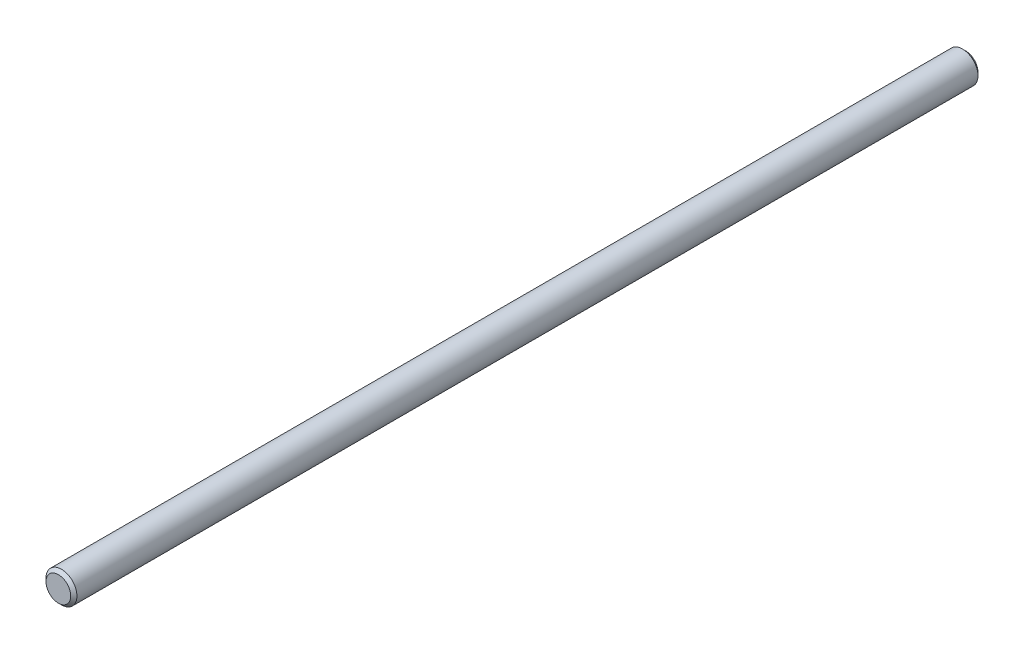
ISO-10303-21;
HEADER;
FILE_DESCRIPTION(('STEP AP214'),'2;1');
FILE_NAME('part.step','',(''),(''),'','','');
FILE_SCHEMA(('AUTOMOTIVE_DESIGN { 1 0 10303 214 1 1 1 1 }'));
ENDSEC;
DATA;
#1=APPLICATION_CONTEXT('core data for automotive mechanical design processes');
#2=APPLICATION_PROTOCOL_DEFINITION('international standard','automotive_design',2000,#1);
#3=PRODUCT_CONTEXT('',#1,'mechanical');
#4=PRODUCT('Part','Part','',(#3));
#5=PRODUCT_RELATED_PRODUCT_CATEGORY('part','',(#4));
#6=PRODUCT_DEFINITION_FORMATION('','',#4);
#7=PRODUCT_DEFINITION_CONTEXT('part definition',#1,'design');
#8=PRODUCT_DEFINITION('design','',#6,#7);
#9=PRODUCT_DEFINITION_SHAPE('','',#8);
#10=(LENGTH_UNIT() NAMED_UNIT(*) SI_UNIT(.MILLI.,.METRE.));
#11=(NAMED_UNIT(*) PLANE_ANGLE_UNIT() SI_UNIT($,.RADIAN.));
#12=(NAMED_UNIT(*) SI_UNIT($,.STERADIAN.) SOLID_ANGLE_UNIT());
#13=UNCERTAINTY_MEASURE_WITH_UNIT(LENGTH_MEASURE(1.E-05),#10,'distance_accuracy_value','');
#14=(GEOMETRIC_REPRESENTATION_CONTEXT(3) GLOBAL_UNCERTAINTY_ASSIGNED_CONTEXT((#13)) GLOBAL_UNIT_ASSIGNED_CONTEXT((#10,
#11,#12)) REPRESENTATION_CONTEXT('',''));
#15=CARTESIAN_POINT('',(0.,0.,0.));
#16=DIRECTION('',(0.,0.,1.));
#17=DIRECTION('',(1.,0.,0.));
#18=AXIS2_PLACEMENT_3D('',#15,#16,#17);
#19=CARTESIAN_POINT('',(0.,0.,279.4));
#20=DIRECTION('',(0.,0.,-1.));
#21=DIRECTION('',(-1.,0.,0.));
#22=AXIS2_PLACEMENT_3D('',#19,#20,#21);
#23=CYLINDRICAL_SURFACE('',#22,9.525);
#24=CARTESIAN_POINT('',(0.,0.,-277.495));
#25=DIRECTION('',(0.,0.,1.));
#26=DIRECTION('',(1.,0.,0.));
#27=AXIS2_PLACEMENT_3D('',#24,#25,#26);
#28=CIRCLE('',#27,9.525);
#29=CARTESIAN_POINT('',(9.525,0.,-277.495));
#30=VERTEX_POINT('',#29);
#31=EDGE_CURVE('E40',#30,#30,#28,.T.);
#32=ORIENTED_EDGE('',*,*,#31,.T.);
#33=EDGE_LOOP('',(#32));
#34=FACE_BOUND('',#33,.T.);
#35=CARTESIAN_POINT('',(0.,0.,277.495));
#36=DIRECTION('',(0.,0.,1.));
#37=DIRECTION('',(1.,0.,0.));
#38=AXIS2_PLACEMENT_3D('',#35,#36,#37);
#39=CIRCLE('',#38,9.525);
#40=CARTESIAN_POINT('',(9.525,0.,277.495));
#41=VERTEX_POINT('',#40);
#42=EDGE_CURVE('E44',#41,#41,#39,.F.);
#43=ORIENTED_EDGE('',*,*,#42,.T.);
#44=EDGE_LOOP('',(#43));
#45=FACE_BOUND('',#44,.T.);
#46=ADVANCED_FACE('F29',(#34,#45),#23,.T.);
#47=CARTESIAN_POINT('',(0.,0.,279.4));
#48=DIRECTION('',(0.,0.,1.));
#49=DIRECTION('',(1.,0.,0.));
#50=AXIS2_PLACEMENT_3D('',#47,#48,#49);
#51=PLANE('',#50);
#52=CARTESIAN_POINT('',(0.,0.,279.4));
#53=DIRECTION('',(0.,0.,1.));
#54=DIRECTION('',(1.,0.,0.));
#55=AXIS2_PLACEMENT_3D('',#52,#53,#54);
#56=CIRCLE('',#55,7.62000000000007);
#57=CARTESIAN_POINT('',(7.62000000000007,0.,279.4));
#58=VERTEX_POINT('',#57);
#59=EDGE_CURVE('E10',#58,#58,#56,.T.);
#60=ORIENTED_EDGE('',*,*,#59,.T.);
#61=EDGE_LOOP('',(#60));
#62=FACE_BOUND('',#61,.T.);
#63=ADVANCED_FACE('F60',(#62),#51,.T.);
#64=CARTESIAN_POINT('',(0.,0.,-279.4));
#65=DIRECTION('',(0.,0.,1.));
#66=DIRECTION('',(1.,0.,0.));
#67=AXIS2_PLACEMENT_3D('',#64,#65,#66);
#68=PLANE('',#67);
#69=CARTESIAN_POINT('',(0.,0.,-279.4));
#70=DIRECTION('',(0.,0.,1.));
#71=DIRECTION('',(1.,0.,0.));
#72=AXIS2_PLACEMENT_3D('',#69,#70,#71);
#73=CIRCLE('',#72,7.61999999999991);
#74=CARTESIAN_POINT('',(7.61999999999991,0.,-279.4));
#75=VERTEX_POINT('',#74);
#76=EDGE_CURVE('E36',#75,#75,#73,.F.);
#77=ORIENTED_EDGE('',*,*,#76,.T.);
#78=EDGE_LOOP('',(#77));
#79=FACE_BOUND('',#78,.T.);
#80=ADVANCED_FACE('F57',(#79),#68,.F.);
#81=CARTESIAN_POINT('',(0.,0.,-277.495));
#82=DIRECTION('',(0.,0.,1.));
#83=DIRECTION('',(1.,0.,0.));
#84=AXIS2_PLACEMENT_3D('',#81,#82,#83);
#85=CONICAL_SURFACE('',#84,9.525,0.785398163397461);
#86=ORIENTED_EDGE('',*,*,#76,.F.);
#87=EDGE_LOOP('',(#86));
#88=FACE_BOUND('',#87,.T.);
#89=ORIENTED_EDGE('',*,*,#31,.F.);
#90=EDGE_LOOP('',(#89));
#91=FACE_BOUND('',#90,.T.);
#92=ADVANCED_FACE('F53',(#88,#91),#85,.T.);
#93=CARTESIAN_POINT('',(0.,0.,279.4));
#94=DIRECTION('',(0.,0.,-1.));
#95=DIRECTION('',(-1.,0.,0.));
#96=AXIS2_PLACEMENT_3D('',#93,#94,#95);
#97=CONICAL_SURFACE('',#96,7.62000000000007,0.785398163397447);
#98=ORIENTED_EDGE('',*,*,#42,.F.);
#99=EDGE_LOOP('',(#98));
#100=FACE_BOUND('',#99,.T.);
#101=ORIENTED_EDGE('',*,*,#59,.F.);
#102=EDGE_LOOP('',(#101));
#103=FACE_BOUND('',#102,.T.);
#104=ADVANCED_FACE('F31',(#100,#103),#97,.T.);
#105=CLOSED_SHELL('',(#46,#63,#80,#92,#104));
#106=MANIFOLD_SOLID_BREP('B2',#105);
#107=ADVANCED_BREP_SHAPE_REPRESENTATION('',(#18,#106),#14);
#108=SHAPE_DEFINITION_REPRESENTATION(#9,#107);
ENDSEC;
END-ISO-10303-21;
